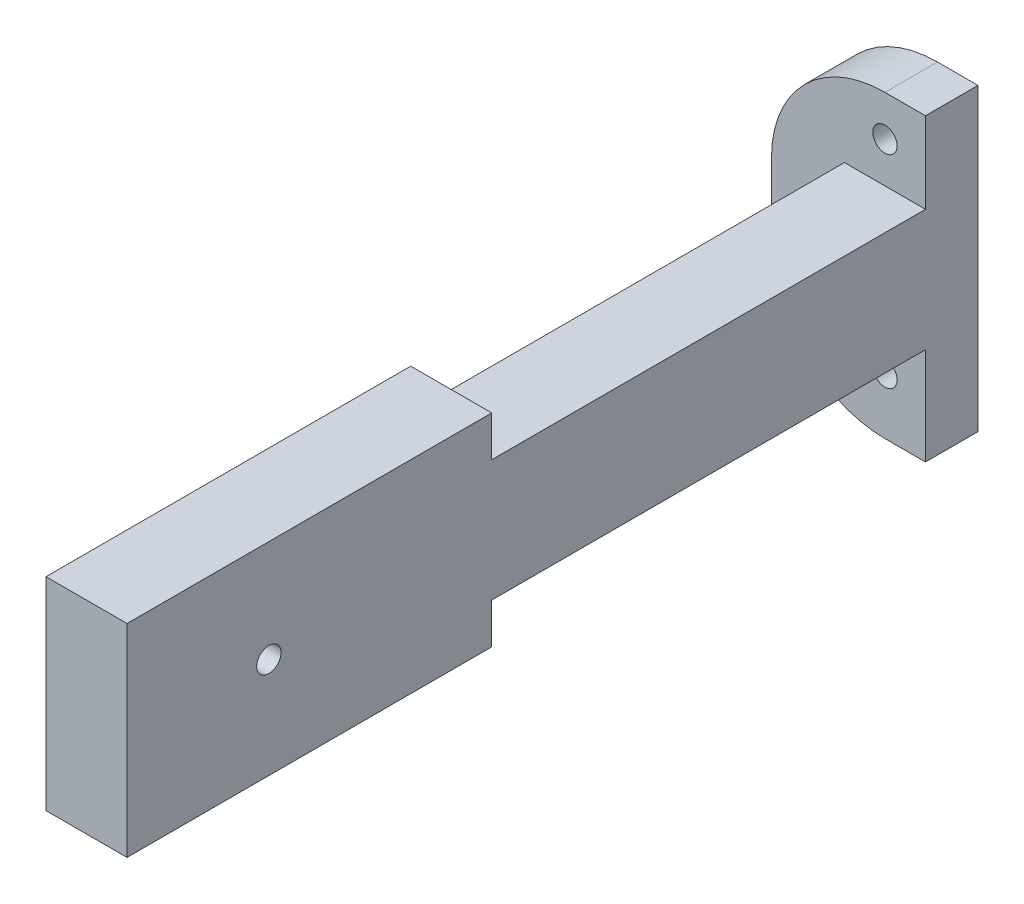
ISO-10303-21;
HEADER;
FILE_DESCRIPTION(('STEP AP214'),'2;1');
FILE_NAME('part.step','',(''),(''),'','','');
FILE_SCHEMA(('AUTOMOTIVE_DESIGN { 1 0 10303 214 1 1 1 1 }'));
ENDSEC;
DATA;
#1=APPLICATION_CONTEXT('core data for automotive mechanical design processes');
#2=APPLICATION_PROTOCOL_DEFINITION('international standard','automotive_design',2000,#1);
#3=PRODUCT_CONTEXT('',#1,'mechanical');
#4=PRODUCT('Part','Part','',(#3));
#5=PRODUCT_RELATED_PRODUCT_CATEGORY('part','',(#4));
#6=PRODUCT_DEFINITION_FORMATION('','',#4);
#7=PRODUCT_DEFINITION_CONTEXT('part definition',#1,'design');
#8=PRODUCT_DEFINITION('design','',#6,#7);
#9=PRODUCT_DEFINITION_SHAPE('','',#8);
#10=(LENGTH_UNIT() NAMED_UNIT(*) SI_UNIT(.MILLI.,.METRE.));
#11=(NAMED_UNIT(*) PLANE_ANGLE_UNIT() SI_UNIT($,.RADIAN.));
#12=(NAMED_UNIT(*) SI_UNIT($,.STERADIAN.) SOLID_ANGLE_UNIT());
#13=UNCERTAINTY_MEASURE_WITH_UNIT(LENGTH_MEASURE(1.E-05),#10,'distance_accuracy_value','');
#14=(GEOMETRIC_REPRESENTATION_CONTEXT(3) GLOBAL_UNCERTAINTY_ASSIGNED_CONTEXT((#13)) GLOBAL_UNIT_ASSIGNED_CONTEXT((#10,
#11,#12)) REPRESENTATION_CONTEXT('',''));
#15=CARTESIAN_POINT('',(0.,0.,0.));
#16=DIRECTION('',(0.,0.,1.));
#17=DIRECTION('',(1.,0.,0.));
#18=AXIS2_PLACEMENT_3D('',#15,#16,#17);
#19=CARTESIAN_POINT('',(-45.,40.,90.2));
#20=DIRECTION('',(0.,0.,1.));
#21=DIRECTION('',(1.,0.,0.));
#22=AXIS2_PLACEMENT_3D('',#19,#20,#21);
#23=PLANE('',#22);
#24=CARTESIAN_POINT('',(-50.,17.,90.2));
#25=DIRECTION('',(0.,0.,1.));
#26=DIRECTION('',(1.,0.,0.));
#27=AXIS2_PLACEMENT_3D('',#24,#25,#26);
#28=CIRCLE('',#27,1.5);
#29=CARTESIAN_POINT('',(-48.5,17.,90.2));
#30=VERTEX_POINT('',#29);
#31=EDGE_CURVE('E256',#30,#30,#28,.F.);
#32=ORIENTED_EDGE('',*,*,#31,.F.);
#33=EDGE_LOOP('',(#32));
#34=FACE_BOUND('',#33,.T.);
#35=CARTESIAN_POINT('',(-60.,4.5,90.2));
#36=DIRECTION('',(0.,0.,1.));
#37=DIRECTION('',(1.,0.,0.));
#38=AXIS2_PLACEMENT_3D('',#35,#36,#37);
#39=CIRCLE('',#38,1.5);
#40=CARTESIAN_POINT('',(-58.5,4.5,90.2));
#41=VERTEX_POINT('',#40);
#42=EDGE_CURVE('E264',#41,#41,#39,.F.);
#43=ORIENTED_EDGE('',*,*,#42,.F.);
#44=EDGE_LOOP('',(#43));
#45=FACE_BOUND('',#44,.T.);
#46=CARTESIAN_POINT('',(-50.,-8.,90.2));
#47=DIRECTION('',(0.,0.,1.));
#48=DIRECTION('',(1.,0.,0.));
#49=AXIS2_PLACEMENT_3D('',#46,#47,#48);
#50=CIRCLE('',#49,1.5);
#51=CARTESIAN_POINT('',(-48.5,-8.,90.2));
#52=VERTEX_POINT('',#51);
#53=EDGE_CURVE('E259',#52,#52,#50,.F.);
#54=ORIENTED_EDGE('',*,*,#53,.F.);
#55=EDGE_LOOP('',(#54));
#56=FACE_BOUND('',#55,.T.);
#57=CARTESIAN_POINT('',(-50.,-1.,90.2));
#58=DIRECTION('',(0.,0.,1.));
#59=DIRECTION('',(1.,0.,0.));
#60=AXIS2_PLACEMENT_3D('',#57,#58,#59);
#61=CIRCLE('',#60,14.);
#62=CARTESIAN_POINT('',(-50.,-15.,90.2));
#63=VERTEX_POINT('',#62);
#64=CARTESIAN_POINT('',(-64.,-1.00000000000001,90.2));
#65=VERTEX_POINT('',#64);
#66=EDGE_CURVE('E165',#63,#65,#61,.F.);
#67=ORIENTED_EDGE('',*,*,#66,.T.);
#68=DIRECTION('',(0.,1.,0.));
#69=VECTOR('',#68,1.);
#70=CARTESIAN_POINT('',(-64.,-15.,90.2));
#71=LINE('',#70,#69);
#72=CARTESIAN_POINT('',(-64.,7.99999999999999,90.2));
#73=VERTEX_POINT('',#72);
#74=EDGE_CURVE('E179',#65,#73,#71,.T.);
#75=ORIENTED_EDGE('',*,*,#74,.T.);
#76=CARTESIAN_POINT('',(-50.,8.,90.2));
#77=DIRECTION('',(0.,0.,1.));
#78=DIRECTION('',(1.,0.,0.));
#79=AXIS2_PLACEMENT_3D('',#76,#77,#78);
#80=CIRCLE('',#79,14.);
#81=CARTESIAN_POINT('',(-50.,22.,90.2));
#82=VERTEX_POINT('',#81);
#83=EDGE_CURVE('E161',#73,#82,#80,.F.);
#84=ORIENTED_EDGE('',*,*,#83,.T.);
#85=DIRECTION('',(1.,0.,0.));
#86=VECTOR('',#85,1.);
#87=CARTESIAN_POINT('',(0.,22.,90.2));
#88=LINE('',#87,#86);
#89=CARTESIAN_POINT('',(-45.,22.,90.2));
#90=VERTEX_POINT('',#89);
#91=EDGE_CURVE('E37',#82,#90,#88,.T.);
#92=ORIENTED_EDGE('',*,*,#91,.T.);
#93=DIRECTION('',(0.,-1.,0.));
#94=VECTOR('',#93,1.);
#95=CARTESIAN_POINT('',(-45.,40.,90.2));
#96=LINE('',#95,#94);
#97=CARTESIAN_POINT('',(-45.,-15.,90.2));
#98=VERTEX_POINT('',#97);
#99=EDGE_CURVE('E168',#90,#98,#96,.T.);
#100=ORIENTED_EDGE('',*,*,#99,.T.);
#101=DIRECTION('',(1.,0.,0.));
#102=VECTOR('',#101,1.);
#103=CARTESIAN_POINT('',(0.,-15.,90.2));
#104=LINE('',#103,#102);
#105=EDGE_CURVE('E254',#63,#98,#104,.T.);
#106=ORIENTED_EDGE('',*,*,#105,.F.);
#107=EDGE_LOOP('',(#67,#75,#84,#92,#100,#106));
#108=FACE_BOUND('',#107,.T.);
#109=ADVANCED_FACE('F33',(#34,#45,#56,#108),#23,.F.);
#110=CARTESIAN_POINT('',(-45.,40.,20.2));
#111=DIRECTION('',(1.,0.,0.));
#112=DIRECTION('',(0.,0.,-1.));
#113=AXIS2_PLACEMENT_3D('',#110,#111,#112);
#114=PLANE('',#113);
#115=CARTESIAN_POINT('',(-45.,4.4,177.7));
#116=DIRECTION('',(1.,0.,0.));
#117=DIRECTION('',(0.,0.,-1.));
#118=AXIS2_PLACEMENT_3D('',#115,#116,#117);
#119=CIRCLE('',#118,1.5);
#120=CARTESIAN_POINT('',(-45.,4.4,176.2));
#121=VERTEX_POINT('',#120);
#122=EDGE_CURVE('E176',#121,#121,#119,.F.);
#123=ORIENTED_EDGE('',*,*,#122,.T.);
#124=EDGE_LOOP('',(#123));
#125=FACE_BOUND('',#124,.T.);
#126=DIRECTION('',(0.,0.,-1.));
#127=VECTOR('',#126,1.);
#128=CARTESIAN_POINT('',(-45.,-8.,160.2));
#129=LINE('',#128,#127);
#130=CARTESIAN_POINT('',(-45.,-8.,195.2));
#131=VERTEX_POINT('',#130);
#132=CARTESIAN_POINT('',(-45.,-8.,150.2));
#133=VERTEX_POINT('',#132);
#134=EDGE_CURVE('E160',#131,#133,#129,.T.);
#135=ORIENTED_EDGE('',*,*,#134,.T.);
#136=DIRECTION('',(0.,1.,0.));
#137=VECTOR('',#136,1.);
#138=CARTESIAN_POINT('',(-45.,0.,150.2));
#139=LINE('',#138,#137);
#140=CARTESIAN_POINT('',(-45.,-3.,150.2));
#141=VERTEX_POINT('',#140);
#142=EDGE_CURVE('E153',#133,#141,#139,.T.);
#143=ORIENTED_EDGE('',*,*,#142,.T.);
#144=DIRECTION('',(0.,0.,-1.));
#145=VECTOR('',#144,1.);
#146=CARTESIAN_POINT('',(-45.,-3.,150.2));
#147=LINE('',#146,#145);
#148=CARTESIAN_POINT('',(-45.,-3.,96.683646445593));
#149=VERTEX_POINT('',#148);
#150=EDGE_CURVE('E138',#141,#149,#147,.T.);
#151=ORIENTED_EDGE('',*,*,#150,.T.);
#152=DIRECTION('',(0.,1.,0.));
#153=VECTOR('',#152,1.);
#154=CARTESIAN_POINT('',(-45.,-15.,96.683646445593));
#155=LINE('',#154,#153);
#156=CARTESIAN_POINT('',(-45.,-15.,96.683646445593));
#157=VERTEX_POINT('',#156);
#158=EDGE_CURVE('E245',#157,#149,#155,.T.);
#159=ORIENTED_EDGE('',*,*,#158,.F.);
#160=DIRECTION('',(0.,0.,-1.));
#161=VECTOR('',#160,1.);
#162=CARTESIAN_POINT('',(-45.,-15.,96.683646445593));
#163=LINE('',#162,#161);
#164=EDGE_CURVE('E217',#157,#98,#163,.T.);
#165=ORIENTED_EDGE('',*,*,#164,.T.);
#166=ORIENTED_EDGE('',*,*,#99,.F.);
#167=DIRECTION('',(0.,0.,-1.));
#168=VECTOR('',#167,1.);
#169=CARTESIAN_POINT('',(-45.,22.,96.683646445593));
#170=LINE('',#169,#168);
#171=CARTESIAN_POINT('',(-45.,22.,96.683646445593));
#172=VERTEX_POINT('',#171);
#173=EDGE_CURVE('E210',#172,#90,#170,.T.);
#174=ORIENTED_EDGE('',*,*,#173,.F.);
#175=CARTESIAN_POINT('',(-45.,12.,96.683646445593));
#176=VERTEX_POINT('',#175);
#177=EDGE_CURVE('E242',#176,#172,#155,.T.);
#178=ORIENTED_EDGE('',*,*,#177,.F.);
#179=DIRECTION('',(0.,0.,-1.));
#180=VECTOR('',#179,1.);
#181=CARTESIAN_POINT('',(-45.,12.,150.2));
#182=LINE('',#181,#180);
#183=CARTESIAN_POINT('',(-45.,12.,150.2));
#184=VERTEX_POINT('',#183);
#185=EDGE_CURVE('E272',#184,#176,#182,.T.);
#186=ORIENTED_EDGE('',*,*,#185,.F.);
#187=CARTESIAN_POINT('',(-45.,17.,150.2));
#188=VERTEX_POINT('',#187);
#189=EDGE_CURVE('E162',#184,#188,#139,.T.);
#190=ORIENTED_EDGE('',*,*,#189,.T.);
#191=DIRECTION('',(0.,0.,1.));
#192=VECTOR('',#191,1.);
#193=CARTESIAN_POINT('',(-45.,17.,160.2));
#194=LINE('',#193,#192);
#195=CARTESIAN_POINT('',(-45.,17.,195.2));
#196=VERTEX_POINT('',#195);
#197=EDGE_CURVE('E173',#188,#196,#194,.T.);
#198=ORIENTED_EDGE('',*,*,#197,.T.);
#199=DIRECTION('',(0.,1.,0.));
#200=VECTOR('',#199,1.);
#201=CARTESIAN_POINT('',(-45.,0.,195.2));
#202=LINE('',#201,#200);
#203=EDGE_CURVE('E171',#131,#196,#202,.T.);
#204=ORIENTED_EDGE('',*,*,#203,.F.);
#205=EDGE_LOOP('',(#135,#143,#151,#159,#165,#166,#174,#178,#186,#190,#198,#204));
#206=FACE_BOUND('',#205,.T.);
#207=ADVANCED_FACE('F158',(#125,#206),#114,.T.);
#208=CARTESIAN_POINT('',(0.,0.,150.2));
#209=DIRECTION('',(0.,0.,1.));
#210=DIRECTION('',(1.,0.,0.));
#211=AXIS2_PLACEMENT_3D('',#208,#209,#210);
#212=PLANE('',#211);
#213=ORIENTED_EDGE('',*,*,#142,.F.);
#214=DIRECTION('',(1.,0.,0.));
#215=VECTOR('',#214,1.);
#216=CARTESIAN_POINT('',(-55.,-8.,150.2));
#217=LINE('',#216,#215);
#218=CARTESIAN_POINT('',(-55.,-8.,150.2));
#219=VERTEX_POINT('',#218);
#220=EDGE_CURVE('E182',#219,#133,#217,.T.);
#221=ORIENTED_EDGE('',*,*,#220,.F.);
#222=DIRECTION('',(0.,-1.,0.));
#223=VECTOR('',#222,1.);
#224=CARTESIAN_POINT('',(-55.,17.,150.2));
#225=LINE('',#224,#223);
#226=CARTESIAN_POINT('',(-55.,-3.,150.2));
#227=VERTEX_POINT('',#226);
#228=EDGE_CURVE('E155',#227,#219,#225,.T.);
#229=ORIENTED_EDGE('',*,*,#228,.F.);
#230=DIRECTION('',(1.,0.,0.));
#231=VECTOR('',#230,1.);
#232=CARTESIAN_POINT('',(-45.,-3.,150.2));
#233=LINE('',#232,#231);
#234=EDGE_CURVE('E142',#227,#141,#233,.T.);
#235=ORIENTED_EDGE('',*,*,#234,.T.);
#236=EDGE_LOOP('',(#213,#221,#229,#235));
#237=FACE_BOUND('',#236,.T.);
#238=ADVANCED_FACE('F151',(#237),#212,.F.);
#239=ORIENTED_EDGE('',*,*,#189,.F.);
#240=DIRECTION('',(-1.,0.,0.));
#241=VECTOR('',#240,1.);
#242=CARTESIAN_POINT('',(-45.,12.,150.2));
#243=LINE('',#242,#241);
#244=CARTESIAN_POINT('',(-55.,12.,150.2));
#245=VERTEX_POINT('',#244);
#246=EDGE_CURVE('E156',#184,#245,#243,.T.);
#247=ORIENTED_EDGE('',*,*,#246,.T.);
#248=CARTESIAN_POINT('',(-55.,17.,150.2));
#249=VERTEX_POINT('',#248);
#250=EDGE_CURVE('E185',#249,#245,#225,.T.);
#251=ORIENTED_EDGE('',*,*,#250,.F.);
#252=DIRECTION('',(-1.,0.,0.));
#253=VECTOR('',#252,1.);
#254=CARTESIAN_POINT('',(-55.,17.,150.2));
#255=LINE('',#254,#253);
#256=EDGE_CURVE('E180',#188,#249,#255,.T.);
#257=ORIENTED_EDGE('',*,*,#256,.F.);
#258=EDGE_LOOP('',(#239,#247,#251,#257));
#259=FACE_BOUND('',#258,.T.);
#260=ADVANCED_FACE('F324',(#259),#212,.F.);
#261=CARTESIAN_POINT('',(-45.,12.,150.2));
#262=DIRECTION('',(0.,-1.,0.));
#263=DIRECTION('',(1.,0.,0.));
#264=AXIS2_PLACEMENT_3D('',#261,#262,#263);
#265=PLANE('',#264);
#266=ORIENTED_EDGE('',*,*,#246,.F.);
#267=ORIENTED_EDGE('',*,*,#185,.T.);
#268=DIRECTION('',(-1.,0.,0.));
#269=VECTOR('',#268,1.);
#270=CARTESIAN_POINT('',(-45.,12.,96.683646445593));
#271=LINE('',#270,#269);
#272=CARTESIAN_POINT('',(-55.,12.,96.683646445593));
#273=VERTEX_POINT('',#272);
#274=EDGE_CURVE('E296',#176,#273,#271,.T.);
#275=ORIENTED_EDGE('',*,*,#274,.T.);
#276=DIRECTION('',(0.,0.,-1.));
#277=VECTOR('',#276,1.);
#278=CARTESIAN_POINT('',(-55.,12.,150.2));
#279=LINE('',#278,#277);
#280=EDGE_CURVE('E275',#245,#273,#279,.T.);
#281=ORIENTED_EDGE('',*,*,#280,.F.);
#282=EDGE_LOOP('',(#266,#267,#275,#281));
#283=FACE_BOUND('',#282,.T.);
#284=ADVANCED_FACE('F308',(#283),#265,.F.);
#285=CARTESIAN_POINT('',(-55.,-3.,150.2));
#286=DIRECTION('',(1.,0.,0.));
#287=DIRECTION('',(0.,0.,-1.));
#288=AXIS2_PLACEMENT_3D('',#285,#286,#287);
#289=PLANE('',#288);
#290=CARTESIAN_POINT('',(-55.,4.4,177.7));
#291=DIRECTION('',(1.,0.,0.));
#292=DIRECTION('',(0.,0.,-1.));
#293=AXIS2_PLACEMENT_3D('',#290,#291,#292);
#294=CIRCLE('',#293,1.5);
#295=CARTESIAN_POINT('',(-55.,4.4,176.2));
#296=VERTEX_POINT('',#295);
#297=EDGE_CURVE('E192',#296,#296,#294,.T.);
#298=ORIENTED_EDGE('',*,*,#297,.T.);
#299=EDGE_LOOP('',(#298));
#300=FACE_BOUND('',#299,.T.);
#301=ORIENTED_EDGE('',*,*,#280,.T.);
#302=DIRECTION('',(0.,-1.,0.));
#303=VECTOR('',#302,1.);
#304=CARTESIAN_POINT('',(-55.,-3.,96.683646445593));
#305=LINE('',#304,#303);
#306=CARTESIAN_POINT('',(-55.,-3.,96.683646445593));
#307=VERTEX_POINT('',#306);
#308=EDGE_CURVE('E248',#273,#307,#305,.T.);
#309=ORIENTED_EDGE('',*,*,#308,.T.);
#310=DIRECTION('',(0.,0.,-1.));
#311=VECTOR('',#310,1.);
#312=CARTESIAN_POINT('',(-55.,-3.,150.2));
#313=LINE('',#312,#311);
#314=EDGE_CURVE('E147',#227,#307,#313,.T.);
#315=ORIENTED_EDGE('',*,*,#314,.F.);
#316=ORIENTED_EDGE('',*,*,#228,.T.);
#317=DIRECTION('',(0.,0.,-1.));
#318=VECTOR('',#317,1.);
#319=CARTESIAN_POINT('',(-55.,-8.,160.2));
#320=LINE('',#319,#318);
#321=CARTESIAN_POINT('',(-55.,-8.,195.2));
#322=VERTEX_POINT('',#321);
#323=EDGE_CURVE('E281',#322,#219,#320,.T.);
#324=ORIENTED_EDGE('',*,*,#323,.F.);
#325=DIRECTION('',(0.,-1.,0.));
#326=VECTOR('',#325,1.);
#327=CARTESIAN_POINT('',(-55.,-8.,195.2));
#328=LINE('',#327,#326);
#329=CARTESIAN_POINT('',(-55.,17.,195.2));
#330=VERTEX_POINT('',#329);
#331=EDGE_CURVE('E189',#330,#322,#328,.T.);
#332=ORIENTED_EDGE('',*,*,#331,.F.);
#333=DIRECTION('',(0.,0.,-1.));
#334=VECTOR('',#333,1.);
#335=CARTESIAN_POINT('',(-55.,17.,160.2));
#336=LINE('',#335,#334);
#337=EDGE_CURVE('E183',#330,#249,#336,.T.);
#338=ORIENTED_EDGE('',*,*,#337,.T.);
#339=ORIENTED_EDGE('',*,*,#250,.T.);
#340=EDGE_LOOP('',(#301,#309,#315,#316,#324,#332,#338,#339));
#341=FACE_BOUND('',#340,.T.);
#342=ADVANCED_FACE('F302',(#300,#341),#289,.F.);
#343=CARTESIAN_POINT('',(-45.,-3.,150.2));
#344=DIRECTION('',(0.,1.,0.));
#345=DIRECTION('',(-1.,0.,0.));
#346=AXIS2_PLACEMENT_3D('',#343,#344,#345);
#347=PLANE('',#346);
#348=ORIENTED_EDGE('',*,*,#150,.F.);
#349=ORIENTED_EDGE('',*,*,#234,.F.);
#350=ORIENTED_EDGE('',*,*,#314,.T.);
#351=DIRECTION('',(1.,0.,0.));
#352=VECTOR('',#351,1.);
#353=CARTESIAN_POINT('',(-45.,-3.,96.683646445593));
#354=LINE('',#353,#352);
#355=EDGE_CURVE('E144',#307,#149,#354,.T.);
#356=ORIENTED_EDGE('',*,*,#355,.T.);
#357=EDGE_LOOP('',(#348,#349,#350,#356));
#358=FACE_BOUND('',#357,.T.);
#359=ADVANCED_FACE('F140',(#358),#347,.F.);
#360=CARTESIAN_POINT('',(-45.,-15.,96.683646445593));
#361=DIRECTION('',(0.,0.,1.));
#362=DIRECTION('',(1.,0.,0.));
#363=AXIS2_PLACEMENT_3D('',#360,#361,#362);
#364=PLANE('',#363);
#365=CARTESIAN_POINT('',(-60.,4.5,96.683646445593));
#366=DIRECTION('',(0.,0.,1.));
#367=DIRECTION('',(1.,0.,0.));
#368=AXIS2_PLACEMENT_3D('',#365,#366,#367);
#369=CIRCLE('',#368,1.5);
#370=CARTESIAN_POINT('',(-58.5,4.5,96.683646445593));
#371=VERTEX_POINT('',#370);
#372=EDGE_CURVE('E11',#371,#371,#369,.T.);
#373=ORIENTED_EDGE('',*,*,#372,.F.);
#374=EDGE_LOOP('',(#373));
#375=FACE_BOUND('',#374,.T.);
#376=CARTESIAN_POINT('',(-50.,-8.,96.683646445593));
#377=DIRECTION('',(0.,0.,1.));
#378=DIRECTION('',(1.,0.,0.));
#379=AXIS2_PLACEMENT_3D('',#376,#377,#378);
#380=CIRCLE('',#379,1.5);
#381=CARTESIAN_POINT('',(-48.5,-8.,96.683646445593));
#382=VERTEX_POINT('',#381);
#383=EDGE_CURVE('E42',#382,#382,#380,.T.);
#384=ORIENTED_EDGE('',*,*,#383,.F.);
#385=EDGE_LOOP('',(#384));
#386=FACE_BOUND('',#385,.T.);
#387=CARTESIAN_POINT('',(-50.,17.,96.683646445593));
#388=DIRECTION('',(0.,0.,1.));
#389=DIRECTION('',(1.,0.,0.));
#390=AXIS2_PLACEMENT_3D('',#387,#388,#389);
#391=CIRCLE('',#390,1.5);
#392=CARTESIAN_POINT('',(-48.5,17.,96.683646445593));
#393=VERTEX_POINT('',#392);
#394=EDGE_CURVE('E213',#393,#393,#391,.T.);
#395=ORIENTED_EDGE('',*,*,#394,.F.);
#396=EDGE_LOOP('',(#395));
#397=FACE_BOUND('',#396,.T.);
#398=DIRECTION('',(0.,1.,0.));
#399=VECTOR('',#398,1.);
#400=CARTESIAN_POINT('',(-64.,-15.,96.683646445593));
#401=LINE('',#400,#399);
#402=CARTESIAN_POINT('',(-64.,-1.00000000000001,96.683646445593));
#403=VERTEX_POINT('',#402);
#404=CARTESIAN_POINT('',(-64.,7.99999999999999,96.683646445593));
#405=VERTEX_POINT('',#404);
#406=EDGE_CURVE('E235',#403,#405,#401,.T.);
#407=ORIENTED_EDGE('',*,*,#406,.F.);
#408=CARTESIAN_POINT('',(-50.,-1.,96.683646445593));
#409=DIRECTION('',(0.,0.,1.));
#410=DIRECTION('',(1.,0.,0.));
#411=AXIS2_PLACEMENT_3D('',#408,#409,#410);
#412=CIRCLE('',#411,14.);
#413=CARTESIAN_POINT('',(-50.,-15.,96.683646445593));
#414=VERTEX_POINT('',#413);
#415=EDGE_CURVE('E199',#403,#414,#412,.T.);
#416=ORIENTED_EDGE('',*,*,#415,.T.);
#417=DIRECTION('',(1.,0.,0.));
#418=VECTOR('',#417,1.);
#419=CARTESIAN_POINT('',(-45.,-15.,96.683646445593));
#420=LINE('',#419,#418);
#421=EDGE_CURVE('E58',#414,#157,#420,.T.);
#422=ORIENTED_EDGE('',*,*,#421,.T.);
#423=ORIENTED_EDGE('',*,*,#158,.T.);
#424=ORIENTED_EDGE('',*,*,#355,.F.);
#425=ORIENTED_EDGE('',*,*,#308,.F.);
#426=ORIENTED_EDGE('',*,*,#274,.F.);
#427=ORIENTED_EDGE('',*,*,#177,.T.);
#428=DIRECTION('',(1.,0.,0.));
#429=VECTOR('',#428,1.);
#430=CARTESIAN_POINT('',(-45.,22.,96.683646445593));
#431=LINE('',#430,#429);
#432=CARTESIAN_POINT('',(-50.,22.,96.683646445593));
#433=VERTEX_POINT('',#432);
#434=EDGE_CURVE('E50',#433,#172,#431,.T.);
#435=ORIENTED_EDGE('',*,*,#434,.F.);
#436=CARTESIAN_POINT('',(-50.,8.,96.683646445593));
#437=DIRECTION('',(0.,0.,1.));
#438=DIRECTION('',(1.,0.,0.));
#439=AXIS2_PLACEMENT_3D('',#436,#437,#438);
#440=CIRCLE('',#439,14.);
#441=EDGE_CURVE('E239',#433,#405,#440,.T.);
#442=ORIENTED_EDGE('',*,*,#441,.T.);
#443=EDGE_LOOP('',(#407,#416,#422,#423,#424,#425,#426,#427,#435,#442));
#444=FACE_BOUND('',#443,.T.);
#445=ADVANCED_FACE('F226',(#375,#386,#397,#444),#364,.T.);
#446=CARTESIAN_POINT('',(-60.,4.5,76.683646445593));
#447=DIRECTION('',(0.,0.,1.));
#448=DIRECTION('',(1.,0.,0.));
#449=AXIS2_PLACEMENT_3D('',#446,#447,#448);
#450=CYLINDRICAL_SURFACE('',#449,1.5);
#451=ORIENTED_EDGE('',*,*,#42,.T.);
#452=EDGE_LOOP('',(#451));
#453=FACE_BOUND('',#452,.T.);
#454=ORIENTED_EDGE('',*,*,#372,.T.);
#455=EDGE_LOOP('',(#454));
#456=FACE_BOUND('',#455,.T.);
#457=ADVANCED_FACE('F229',(#453,#456),#450,.F.);
#458=CARTESIAN_POINT('',(-50.,-8.,76.683646445593));
#459=DIRECTION('',(0.,0.,1.));
#460=DIRECTION('',(1.,0.,0.));
#461=AXIS2_PLACEMENT_3D('',#458,#459,#460);
#462=CYLINDRICAL_SURFACE('',#461,1.5);
#463=ORIENTED_EDGE('',*,*,#53,.T.);
#464=EDGE_LOOP('',(#463));
#465=FACE_BOUND('',#464,.T.);
#466=ORIENTED_EDGE('',*,*,#383,.T.);
#467=EDGE_LOOP('',(#466));
#468=FACE_BOUND('',#467,.T.);
#469=ADVANCED_FACE('F224',(#465,#468),#462,.F.);
#470=CARTESIAN_POINT('',(-50.,17.,76.683646445593));
#471=DIRECTION('',(0.,0.,1.));
#472=DIRECTION('',(1.,0.,0.));
#473=AXIS2_PLACEMENT_3D('',#470,#471,#472);
#474=CYLINDRICAL_SURFACE('',#473,1.5);
#475=ORIENTED_EDGE('',*,*,#31,.T.);
#476=EDGE_LOOP('',(#475));
#477=FACE_BOUND('',#476,.T.);
#478=ORIENTED_EDGE('',*,*,#394,.T.);
#479=EDGE_LOOP('',(#478));
#480=FACE_BOUND('',#479,.T.);
#481=ADVANCED_FACE('F351',(#477,#480),#474,.F.);
#482=CARTESIAN_POINT('',(-50.,8.,0.));
#483=DIRECTION('',(0.,0.,1.));
#484=DIRECTION('',(1.,0.,0.));
#485=AXIS2_PLACEMENT_3D('',#482,#483,#484);
#486=CYLINDRICAL_SURFACE('',#485,14.);
#487=ORIENTED_EDGE('',*,*,#83,.F.);
#488=DIRECTION('',(0.,0.,1.));
#489=VECTOR('',#488,1.);
#490=CARTESIAN_POINT('',(-64.,7.99999999999999,96.683646445593));
#491=LINE('',#490,#489);
#492=EDGE_CURVE('E195',#405,#73,#491,.F.);
#493=ORIENTED_EDGE('',*,*,#492,.F.);
#494=ORIENTED_EDGE('',*,*,#441,.F.);
#495=DIRECTION('',(0.,0.,1.));
#496=VECTOR('',#495,1.);
#497=CARTESIAN_POINT('',(-50.,22.,0.));
#498=LINE('',#497,#496);
#499=EDGE_CURVE('E193',#82,#433,#498,.T.);
#500=ORIENTED_EDGE('',*,*,#499,.F.);
#501=EDGE_LOOP('',(#487,#493,#494,#500));
#502=FACE_BOUND('',#501,.T.);
#503=ADVANCED_FACE('F348',(#502),#486,.T.);
#504=CARTESIAN_POINT('',(0.,22.,0.));
#505=DIRECTION('',(0.,1.,0.));
#506=DIRECTION('',(-1.,0.,0.));
#507=AXIS2_PLACEMENT_3D('',#504,#505,#506);
#508=PLANE('',#507);
#509=ORIENTED_EDGE('',*,*,#91,.F.);
#510=ORIENTED_EDGE('',*,*,#499,.T.);
#511=ORIENTED_EDGE('',*,*,#434,.T.);
#512=ORIENTED_EDGE('',*,*,#173,.T.);
#513=EDGE_LOOP('',(#509,#510,#511,#512));
#514=FACE_BOUND('',#513,.T.);
#515=ADVANCED_FACE('F211',(#514),#508,.T.);
#516=CARTESIAN_POINT('',(-50.,-1.,0.));
#517=DIRECTION('',(0.,0.,1.));
#518=DIRECTION('',(1.,0.,0.));
#519=AXIS2_PLACEMENT_3D('',#516,#517,#518);
#520=CYLINDRICAL_SURFACE('',#519,14.);
#521=ORIENTED_EDGE('',*,*,#66,.F.);
#522=DIRECTION('',(0.,0.,-1.));
#523=VECTOR('',#522,1.);
#524=CARTESIAN_POINT('',(-50.,-15.,0.));
#525=LINE('',#524,#523);
#526=EDGE_CURVE('E198',#414,#63,#525,.T.);
#527=ORIENTED_EDGE('',*,*,#526,.F.);
#528=ORIENTED_EDGE('',*,*,#415,.F.);
#529=DIRECTION('',(0.,0.,-1.));
#530=VECTOR('',#529,1.);
#531=CARTESIAN_POINT('',(-64.,-1.00000000000001,0.));
#532=LINE('',#531,#530);
#533=EDGE_CURVE('E196',#65,#403,#532,.F.);
#534=ORIENTED_EDGE('',*,*,#533,.F.);
#535=EDGE_LOOP('',(#521,#527,#528,#534));
#536=FACE_BOUND('',#535,.T.);
#537=ADVANCED_FACE('F344',(#536),#520,.T.);
#538=CARTESIAN_POINT('',(0.,-15.,0.));
#539=DIRECTION('',(0.,1.,0.));
#540=DIRECTION('',(-1.,0.,0.));
#541=AXIS2_PLACEMENT_3D('',#538,#539,#540);
#542=PLANE('',#541);
#543=ORIENTED_EDGE('',*,*,#526,.T.);
#544=ORIENTED_EDGE('',*,*,#105,.T.);
#545=ORIENTED_EDGE('',*,*,#164,.F.);
#546=ORIENTED_EDGE('',*,*,#421,.F.);
#547=EDGE_LOOP('',(#543,#544,#545,#546));
#548=FACE_BOUND('',#547,.T.);
#549=ADVANCED_FACE('F253',(#548),#542,.F.);
#550=CARTESIAN_POINT('',(-64.,-15.,96.683646445593));
#551=DIRECTION('',(-1.,0.,0.));
#552=DIRECTION('',(0.,-1.,0.));
#553=AXIS2_PLACEMENT_3D('',#550,#551,#552);
#554=PLANE('',#553);
#555=ORIENTED_EDGE('',*,*,#74,.F.);
#556=ORIENTED_EDGE('',*,*,#533,.T.);
#557=ORIENTED_EDGE('',*,*,#406,.T.);
#558=ORIENTED_EDGE('',*,*,#492,.T.);
#559=EDGE_LOOP('',(#555,#556,#557,#558));
#560=FACE_BOUND('',#559,.T.);
#561=ADVANCED_FACE('F356',(#560),#554,.T.);
#562=CARTESIAN_POINT('',(-69.,4.4,177.7));
#563=DIRECTION('',(1.,0.,0.));
#564=DIRECTION('',(0.,0.,-1.));
#565=AXIS2_PLACEMENT_3D('',#562,#563,#564);
#566=CYLINDRICAL_SURFACE('',#565,1.5);
#567=ORIENTED_EDGE('',*,*,#297,.F.);
#568=EDGE_LOOP('',(#567));
#569=FACE_BOUND('',#568,.T.);
#570=ORIENTED_EDGE('',*,*,#122,.F.);
#571=EDGE_LOOP('',(#570));
#572=FACE_BOUND('',#571,.T.);
#573=ADVANCED_FACE('F358',(#569,#572),#566,.F.);
#574=CARTESIAN_POINT('',(-55.,17.,160.2));
#575=DIRECTION('',(0.,-1.,0.));
#576=DIRECTION('',(0.,0.,-1.));
#577=AXIS2_PLACEMENT_3D('',#574,#575,#576);
#578=PLANE('',#577);
#579=ORIENTED_EDGE('',*,*,#197,.F.);
#580=ORIENTED_EDGE('',*,*,#256,.T.);
#581=ORIENTED_EDGE('',*,*,#337,.F.);
#582=DIRECTION('',(-1.,0.,0.));
#583=VECTOR('',#582,1.);
#584=CARTESIAN_POINT('',(-20.,17.,195.2));
#585=LINE('',#584,#583);
#586=EDGE_CURVE('E190',#196,#330,#585,.T.);
#587=ORIENTED_EDGE('',*,*,#586,.F.);
#588=EDGE_LOOP('',(#579,#580,#581,#587));
#589=FACE_BOUND('',#588,.T.);
#590=ADVANCED_FACE('F314',(#589),#578,.F.);
#591=CARTESIAN_POINT('',(-55.,-8.,160.2));
#592=DIRECTION('',(0.,1.,0.));
#593=DIRECTION('',(0.,0.,1.));
#594=AXIS2_PLACEMENT_3D('',#591,#592,#593);
#595=PLANE('',#594);
#596=ORIENTED_EDGE('',*,*,#134,.F.);
#597=DIRECTION('',(1.,0.,0.));
#598=VECTOR('',#597,1.);
#599=CARTESIAN_POINT('',(-20.,-8.,195.2));
#600=LINE('',#599,#598);
#601=EDGE_CURVE('E186',#322,#131,#600,.T.);
#602=ORIENTED_EDGE('',*,*,#601,.F.);
#603=ORIENTED_EDGE('',*,*,#323,.T.);
#604=ORIENTED_EDGE('',*,*,#220,.T.);
#605=EDGE_LOOP('',(#596,#602,#603,#604));
#606=FACE_BOUND('',#605,.T.);
#607=ADVANCED_FACE('F321',(#606),#595,.F.);
#608=CARTESIAN_POINT('',(0.,0.,195.2));
#609=DIRECTION('',(0.,0.,1.));
#610=DIRECTION('',(1.,0.,0.));
#611=AXIS2_PLACEMENT_3D('',#608,#609,#610);
#612=PLANE('',#611);
#613=ORIENTED_EDGE('',*,*,#601,.T.);
#614=ORIENTED_EDGE('',*,*,#203,.T.);
#615=ORIENTED_EDGE('',*,*,#586,.T.);
#616=ORIENTED_EDGE('',*,*,#331,.T.);
#617=EDGE_LOOP('',(#613,#614,#615,#616));
#618=FACE_BOUND('',#617,.T.);
#619=ADVANCED_FACE('F35',(#618),#612,.T.);
#620=CLOSED_SHELL('',(#109,#207,#238,#260,#284,#342,#359,#445,#457,#469,#481,#503,#515,#537,
#549,#561,#573,#590,#607,#619));
#621=MANIFOLD_SOLID_BREP('B2',#620);
#622=ADVANCED_BREP_SHAPE_REPRESENTATION('',(#18,#621),#14);
#623=SHAPE_DEFINITION_REPRESENTATION(#9,#622);
ENDSEC;
END-ISO-10303-21;
